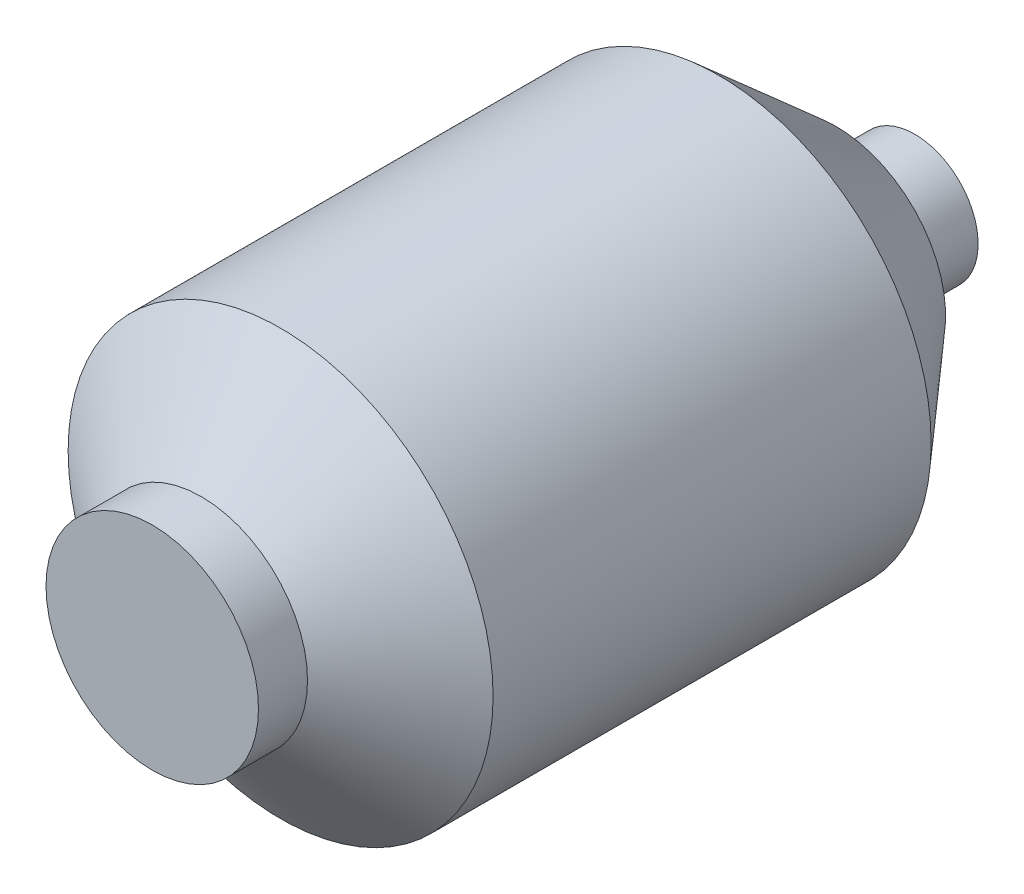
ISO-10303-21;
HEADER;
FILE_DESCRIPTION(('STEP AP214'),'2;1');
FILE_NAME('part.step','',(''),(''),'','','');
FILE_SCHEMA(('AUTOMOTIVE_DESIGN { 1 0 10303 214 1 1 1 1 }'));
ENDSEC;
DATA;
#1=APPLICATION_CONTEXT('core data for automotive mechanical design processes');
#2=APPLICATION_PROTOCOL_DEFINITION('international standard','automotive_design',2000,#1);
#3=PRODUCT_CONTEXT('',#1,'mechanical');
#4=PRODUCT('Part','Part','',(#3));
#5=PRODUCT_RELATED_PRODUCT_CATEGORY('part','',(#4));
#6=PRODUCT_DEFINITION_FORMATION('','',#4);
#7=PRODUCT_DEFINITION_CONTEXT('part definition',#1,'design');
#8=PRODUCT_DEFINITION('design','',#6,#7);
#9=PRODUCT_DEFINITION_SHAPE('','',#8);
#10=(LENGTH_UNIT() NAMED_UNIT(*) SI_UNIT(.MILLI.,.METRE.));
#11=(NAMED_UNIT(*) PLANE_ANGLE_UNIT() SI_UNIT($,.RADIAN.));
#12=(NAMED_UNIT(*) SI_UNIT($,.STERADIAN.) SOLID_ANGLE_UNIT());
#13=UNCERTAINTY_MEASURE_WITH_UNIT(LENGTH_MEASURE(1.E-05),#10,'distance_accuracy_value','');
#14=(GEOMETRIC_REPRESENTATION_CONTEXT(3) GLOBAL_UNCERTAINTY_ASSIGNED_CONTEXT((#13)) GLOBAL_UNIT_ASSIGNED_CONTEXT((#10,
#11,#12)) REPRESENTATION_CONTEXT('',''));
#15=CARTESIAN_POINT('',(0.,0.,0.));
#16=DIRECTION('',(0.,0.,1.));
#17=DIRECTION('',(1.,0.,0.));
#18=AXIS2_PLACEMENT_3D('',#15,#16,#17);
#19=CARTESIAN_POINT('',(0.,0.,-73.0836870656012));
#20=DIRECTION('',(0.,0.,-1.));
#21=DIRECTION('',(-1.,0.,0.));
#22=AXIS2_PLACEMENT_3D('',#19,#20,#21);
#23=CYLINDRICAL_SURFACE('',#22,19.3734575782176);
#24=CARTESIAN_POINT('',(0.,0.,-46.846883116883));
#25=DIRECTION('',(0.,0.,-1.));
#26=DIRECTION('',(-1.,0.,0.));
#27=AXIS2_PLACEMENT_3D('',#24,#25,#26);
#28=CIRCLE('',#27,19.3734575782176);
#29=CARTESIAN_POINT('',(-19.3734575782176,0.,-46.846883116883));
#30=VERTEX_POINT('',#29);
#31=EDGE_CURVE('E12',#30,#30,#28,.T.);
#32=ORIENTED_EDGE('',*,*,#31,.T.);
#33=EDGE_LOOP('',(#32));
#34=FACE_BOUND('',#33,.T.);
#35=CARTESIAN_POINT('',(0.,0.,-68.116883116883));
#36=DIRECTION('',(0.,0.,-1.));
#37=DIRECTION('',(-1.,0.,0.));
#38=AXIS2_PLACEMENT_3D('',#35,#36,#37);
#39=CIRCLE('',#38,19.3734575782176);
#40=CARTESIAN_POINT('',(-19.3734575782176,0.,-68.116883116883));
#41=VERTEX_POINT('',#40);
#42=EDGE_CURVE('E67',#41,#41,#39,.T.);
#43=ORIENTED_EDGE('',*,*,#42,.F.);
#44=EDGE_LOOP('',(#43));
#45=FACE_BOUND('',#44,.T.);
#46=ADVANCED_FACE('F42',(#34,#45),#23,.T.);
#47=CARTESIAN_POINT('',(0.,0.,-46.846883116883));
#48=DIRECTION('',(0.,0.,1.));
#49=DIRECTION('',(1.,0.,0.));
#50=AXIS2_PLACEMENT_3D('',#47,#48,#49);
#51=CONICAL_SURFACE('',#50,19.3734575782176,1.37515518972704);
#52=CARTESIAN_POINT('',(0.,0.,-44.0509220187977));
#53=DIRECTION('',(0.,0.,-1.));
#54=DIRECTION('',(-1.,0.,0.));
#55=AXIS2_PLACEMENT_3D('',#52,#53,#54);
#56=CIRCLE('',#55,33.4819296223735);
#57=CARTESIAN_POINT('',(-33.4819296223735,0.,-44.0509220187977));
#58=VERTEX_POINT('',#57);
#59=EDGE_CURVE('E48',#58,#58,#56,.T.);
#60=ORIENTED_EDGE('',*,*,#59,.T.);
#61=EDGE_LOOP('',(#60));
#62=FACE_BOUND('',#61,.T.);
#63=ORIENTED_EDGE('',*,*,#31,.F.);
#64=EDGE_LOOP('',(#63));
#65=FACE_BOUND('',#64,.T.);
#66=ADVANCED_FACE('F74',(#62,#65),#51,.T.);
#67=CARTESIAN_POINT('',(0.,0.,-44.0509220187977));
#68=DIRECTION('',(0.,0.,1.));
#69=DIRECTION('',(1.,0.,0.));
#70=AXIS2_PLACEMENT_3D('',#67,#68,#69);
#71=CONICAL_SURFACE('',#70,33.4819296223735,0.720023252617397);
#72=CARTESIAN_POINT('',(0.,0.,-8.11688311688305));
#73=DIRECTION('',(0.,0.,-1.));
#74=DIRECTION('',(-1.,0.,0.));
#75=AXIS2_PLACEMENT_3D('',#72,#73,#74);
#76=CIRCLE('',#75,65.);
#77=CARTESIAN_POINT('',(-65.,0.,-8.11688311688305));
#78=VERTEX_POINT('',#77);
#79=EDGE_CURVE('E52',#78,#78,#76,.T.);
#80=ORIENTED_EDGE('',*,*,#79,.T.);
#81=EDGE_LOOP('',(#80));
#82=FACE_BOUND('',#81,.T.);
#83=ORIENTED_EDGE('',*,*,#59,.F.);
#84=EDGE_LOOP('',(#83));
#85=FACE_BOUND('',#84,.T.);
#86=ADVANCED_FACE('F78',(#82,#85),#71,.T.);
#87=CARTESIAN_POINT('',(0.,0.,-73.0836870656012));
#88=DIRECTION('',(0.,0.,-1.));
#89=DIRECTION('',(-1.,0.,0.));
#90=AXIS2_PLACEMENT_3D('',#87,#88,#89);
#91=CYLINDRICAL_SURFACE('',#90,65.);
#92=CARTESIAN_POINT('',(0.,0.,125.883116883117));
#93=DIRECTION('',(0.,0.,-1.));
#94=DIRECTION('',(-1.,0.,0.));
#95=AXIS2_PLACEMENT_3D('',#92,#93,#94);
#96=CIRCLE('',#95,65.);
#97=CARTESIAN_POINT('',(-65.,0.,125.883116883117));
#98=VERTEX_POINT('',#97);
#99=EDGE_CURVE('E56',#98,#98,#96,.T.);
#100=ORIENTED_EDGE('',*,*,#99,.T.);
#101=EDGE_LOOP('',(#100));
#102=FACE_BOUND('',#101,.T.);
#103=ORIENTED_EDGE('',*,*,#79,.F.);
#104=EDGE_LOOP('',(#103));
#105=FACE_BOUND('',#104,.T.);
#106=ADVANCED_FACE('F82',(#102,#105),#91,.T.);
#107=CARTESIAN_POINT('',(0.,0.,125.883116883117));
#108=DIRECTION('',(0.,0.,-1.));
#109=DIRECTION('',(-1.,0.,0.));
#110=AXIS2_PLACEMENT_3D('',#107,#108,#109);
#111=CONICAL_SURFACE('',#110,65.,0.929366118842752);
#112=CARTESIAN_POINT('',(0.,0.,150.153116883117));
#113=DIRECTION('',(0.,0.,-1.));
#114=DIRECTION('',(-1.,0.,0.));
#115=AXIS2_PLACEMENT_3D('',#112,#113,#114);
#116=CIRCLE('',#115,32.5);
#117=CARTESIAN_POINT('',(-32.5,0.,150.153116883117));
#118=VERTEX_POINT('',#117);
#119=EDGE_CURVE('E61',#118,#118,#116,.T.);
#120=ORIENTED_EDGE('',*,*,#119,.T.);
#121=EDGE_LOOP('',(#120));
#122=FACE_BOUND('',#121,.T.);
#123=ORIENTED_EDGE('',*,*,#99,.F.);
#124=EDGE_LOOP('',(#123));
#125=FACE_BOUND('',#124,.T.);
#126=ADVANCED_FACE('F89',(#122,#125),#111,.T.);
#127=CARTESIAN_POINT('',(0.,0.,-73.0836870656012));
#128=DIRECTION('',(0.,0.,-1.));
#129=DIRECTION('',(-1.,0.,0.));
#130=AXIS2_PLACEMENT_3D('',#127,#128,#129);
#131=CYLINDRICAL_SURFACE('',#130,32.5);
#132=CARTESIAN_POINT('',(0.,0.,165.153116883117));
#133=DIRECTION('',(0.,0.,-1.));
#134=DIRECTION('',(-1.,0.,0.));
#135=AXIS2_PLACEMENT_3D('',#132,#133,#134);
#136=CIRCLE('',#135,32.5);
#137=CARTESIAN_POINT('',(-32.5,0.,165.153116883117));
#138=VERTEX_POINT('',#137);
#139=EDGE_CURVE('E64',#138,#138,#136,.T.);
#140=ORIENTED_EDGE('',*,*,#139,.T.);
#141=EDGE_LOOP('',(#140));
#142=FACE_BOUND('',#141,.T.);
#143=ORIENTED_EDGE('',*,*,#119,.F.);
#144=EDGE_LOOP('',(#143));
#145=FACE_BOUND('',#144,.T.);
#146=ADVANCED_FACE('F93',(#142,#145),#131,.T.);
#147=CARTESIAN_POINT('',(-32.5,0.,165.153116883117));
#148=DIRECTION('',(0.,0.,1.));
#149=DIRECTION('',(1.,0.,0.));
#150=AXIS2_PLACEMENT_3D('',#147,#148,#149);
#151=PLANE('',#150);
#152=ORIENTED_EDGE('',*,*,#139,.F.);
#153=EDGE_LOOP('',(#152));
#154=FACE_BOUND('',#153,.T.);
#155=ADVANCED_FACE('F97',(#154),#151,.T.);
#156=CARTESIAN_POINT('',(0.,0.,-68.116883116883));
#157=DIRECTION('',(0.,0.,-1.));
#158=DIRECTION('',(-1.,0.,0.));
#159=AXIS2_PLACEMENT_3D('',#156,#157,#158);
#160=PLANE('',#159);
#161=ORIENTED_EDGE('',*,*,#42,.T.);
#162=EDGE_LOOP('',(#161));
#163=FACE_BOUND('',#162,.T.);
#164=ADVANCED_FACE('F71',(#163),#160,.T.);
#165=CLOSED_SHELL('',(#46,#66,#86,#106,#126,#146,#155,#164));
#166=MANIFOLD_SOLID_BREP('B2',#165);
#167=ADVANCED_BREP_SHAPE_REPRESENTATION('',(#18,#166),#14);
#168=SHAPE_DEFINITION_REPRESENTATION(#9,#167);
ENDSEC;
END-ISO-10303-21;
